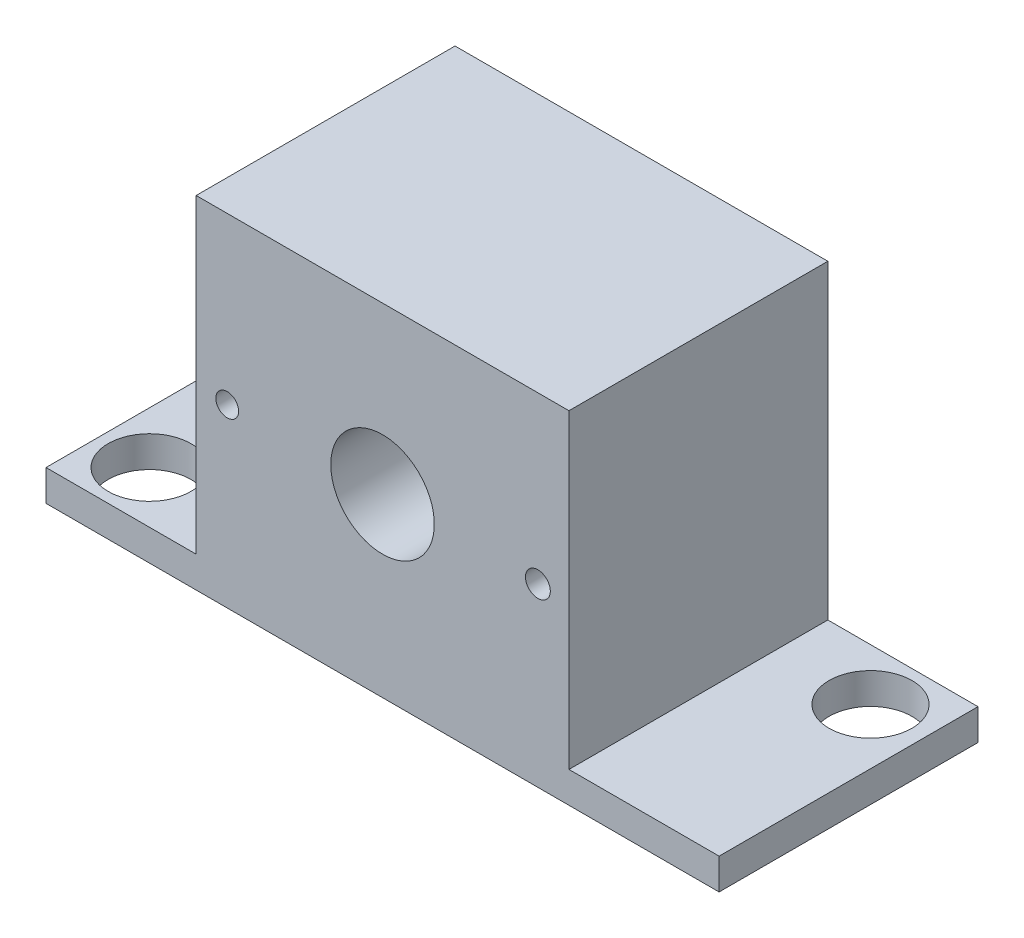
ISO-10303-21;
HEADER;
FILE_DESCRIPTION(('STEP AP214'),'2;1');
FILE_NAME('part.step','',(''),(''),'','','');
FILE_SCHEMA(('AUTOMOTIVE_DESIGN { 1 0 10303 214 1 1 1 1 }'));
ENDSEC;
DATA;
#1=APPLICATION_CONTEXT('core data for automotive mechanical design processes');
#2=APPLICATION_PROTOCOL_DEFINITION('international standard','automotive_design',2000,#1);
#3=PRODUCT_CONTEXT('',#1,'mechanical');
#4=PRODUCT('Part','Part','',(#3));
#5=PRODUCT_RELATED_PRODUCT_CATEGORY('part','',(#4));
#6=PRODUCT_DEFINITION_FORMATION('','',#4);
#7=PRODUCT_DEFINITION_CONTEXT('part definition',#1,'design');
#8=PRODUCT_DEFINITION('design','',#6,#7);
#9=PRODUCT_DEFINITION_SHAPE('','',#8);
#10=(LENGTH_UNIT() NAMED_UNIT(*) SI_UNIT(.MILLI.,.METRE.));
#11=(NAMED_UNIT(*) PLANE_ANGLE_UNIT() SI_UNIT($,.RADIAN.));
#12=(NAMED_UNIT(*) SI_UNIT($,.STERADIAN.) SOLID_ANGLE_UNIT());
#13=UNCERTAINTY_MEASURE_WITH_UNIT(LENGTH_MEASURE(1.E-05),#10,'distance_accuracy_value','');
#14=(GEOMETRIC_REPRESENTATION_CONTEXT(3) GLOBAL_UNCERTAINTY_ASSIGNED_CONTEXT((#13)) GLOBAL_UNIT_ASSIGNED_CONTEXT((#10,
#11,#12)) REPRESENTATION_CONTEXT('',''));
#15=CARTESIAN_POINT('',(0.,0.,0.));
#16=DIRECTION('',(0.,0.,1.));
#17=DIRECTION('',(1.,0.,0.));
#18=AXIS2_PLACEMENT_3D('',#15,#16,#17);
#19=CARTESIAN_POINT('',(-32.5,3.,-12.5));
#20=DIRECTION('',(0.,0.,1.));
#21=DIRECTION('',(1.,0.,0.));
#22=AXIS2_PLACEMENT_3D('',#19,#20,#21);
#23=PLANE('',#22);
#24=CARTESIAN_POINT('',(-15.,17.,-12.5));
#25=DIRECTION('',(0.,0.,-1.));
#26=DIRECTION('',(-1.,0.,0.));
#27=AXIS2_PLACEMENT_3D('',#24,#25,#26);
#28=CIRCLE('',#27,1.09999999999999);
#29=CARTESIAN_POINT('',(-16.1,17.,-12.5));
#30=VERTEX_POINT('',#29);
#31=EDGE_CURVE('E209',#30,#30,#28,.T.);
#32=ORIENTED_EDGE('',*,*,#31,.F.);
#33=EDGE_LOOP('',(#32));
#34=FACE_BOUND('',#33,.T.);
#35=CARTESIAN_POINT('',(15.,17.,-12.5));
#36=DIRECTION('',(0.,0.,-1.));
#37=DIRECTION('',(-1.,0.,0.));
#38=AXIS2_PLACEMENT_3D('',#35,#36,#37);
#39=CIRCLE('',#38,1.2);
#40=CARTESIAN_POINT('',(13.8,17.,-12.5));
#41=VERTEX_POINT('',#40);
#42=EDGE_CURVE('E198',#41,#41,#39,.T.);
#43=ORIENTED_EDGE('',*,*,#42,.F.);
#44=EDGE_LOOP('',(#43));
#45=FACE_BOUND('',#44,.T.);
#46=DIRECTION('',(-1.,0.,0.));
#47=VECTOR('',#46,1.);
#48=CARTESIAN_POINT('',(-32.5,0.,-12.5));
#49=LINE('',#48,#47);
#50=CARTESIAN_POINT('',(32.5,0.,-12.5));
#51=VERTEX_POINT('',#50);
#52=CARTESIAN_POINT('',(-32.5,0.,-12.5));
#53=VERTEX_POINT('',#52);
#54=EDGE_CURVE('E457',#51,#53,#49,.T.);
#55=ORIENTED_EDGE('',*,*,#54,.T.);
#56=DIRECTION('',(0.,-1.,0.));
#57=VECTOR('',#56,1.);
#58=CARTESIAN_POINT('',(-32.5,3.,-12.5));
#59=LINE('',#58,#57);
#60=CARTESIAN_POINT('',(-32.5,3.,-12.5));
#61=VERTEX_POINT('',#60);
#62=EDGE_CURVE('E43',#61,#53,#59,.T.);
#63=ORIENTED_EDGE('',*,*,#62,.F.);
#64=DIRECTION('',(-1.,0.,0.));
#65=VECTOR('',#64,1.);
#66=CARTESIAN_POINT('',(-32.5,3.,-12.5));
#67=LINE('',#66,#65);
#68=CARTESIAN_POINT('',(-18.,3.,-12.5));
#69=VERTEX_POINT('',#68);
#70=EDGE_CURVE('E476',#69,#61,#67,.T.);
#71=ORIENTED_EDGE('',*,*,#70,.F.);
#72=DIRECTION('',(0.,1.,0.));
#73=VECTOR('',#72,1.);
#74=CARTESIAN_POINT('',(-18.,33.,-12.5));
#75=LINE('',#74,#73);
#76=CARTESIAN_POINT('',(-18.,33.,-12.5));
#77=VERTEX_POINT('',#76);
#78=EDGE_CURVE('E170',#69,#77,#75,.T.);
#79=ORIENTED_EDGE('',*,*,#78,.T.);
#80=DIRECTION('',(1.,0.,0.));
#81=VECTOR('',#80,1.);
#82=CARTESIAN_POINT('',(18.,33.,-12.5));
#83=LINE('',#82,#81);
#84=CARTESIAN_POINT('',(18.,33.,-12.5));
#85=VERTEX_POINT('',#84);
#86=EDGE_CURVE('E174',#77,#85,#83,.T.);
#87=ORIENTED_EDGE('',*,*,#86,.T.);
#88=DIRECTION('',(0.,-1.,0.));
#89=VECTOR('',#88,1.);
#90=CARTESIAN_POINT('',(18.,33.,-12.5));
#91=LINE('',#90,#89);
#92=CARTESIAN_POINT('',(18.,3.,-12.5));
#93=VERTEX_POINT('',#92);
#94=EDGE_CURVE('E182',#85,#93,#91,.T.);
#95=ORIENTED_EDGE('',*,*,#94,.T.);
#96=CARTESIAN_POINT('',(32.5,3.,-12.5));
#97=VERTEX_POINT('',#96);
#98=EDGE_CURVE('E472',#97,#93,#67,.T.);
#99=ORIENTED_EDGE('',*,*,#98,.F.);
#100=DIRECTION('',(0.,-1.,0.));
#101=VECTOR('',#100,1.);
#102=CARTESIAN_POINT('',(32.5,3.,-12.5));
#103=LINE('',#102,#101);
#104=EDGE_CURVE('E11',#97,#51,#103,.T.);
#105=ORIENTED_EDGE('',*,*,#104,.T.);
#106=EDGE_LOOP('',(#55,#63,#71,#79,#87,#95,#99,#105));
#107=FACE_BOUND('',#106,.T.);
#108=DIRECTION('',(-1.,0.,0.));
#109=VECTOR('',#108,1.);
#110=CARTESIAN_POINT('',(15.,30.,-12.5));
#111=LINE('',#110,#109);
#112=CARTESIAN_POINT('',(15.,30.,-12.5));
#113=VERTEX_POINT('',#112);
#114=CARTESIAN_POINT('',(-15.,30.,-12.5));
#115=VERTEX_POINT('',#114);
#116=EDGE_CURVE('E51',#113,#115,#111,.T.);
#117=ORIENTED_EDGE('',*,*,#116,.T.);
#118=DIRECTION('',(0.,-1.,0.));
#119=VECTOR('',#118,1.);
#120=CARTESIAN_POINT('',(-15.,30.,-12.5));
#121=LINE('',#120,#119);
#122=CARTESIAN_POINT('',(-15.,19.5,-12.5));
#123=VERTEX_POINT('',#122);
#124=EDGE_CURVE('E169',#115,#123,#121,.T.);
#125=ORIENTED_EDGE('',*,*,#124,.T.);
#126=CARTESIAN_POINT('',(-15.,17.,-12.5));
#127=DIRECTION('',(0.,0.,-1.));
#128=DIRECTION('',(-1.,0.,0.));
#129=AXIS2_PLACEMENT_3D('',#126,#127,#128);
#130=CIRCLE('',#129,2.5);
#131=CARTESIAN_POINT('',(-15.,14.5,-12.5));
#132=VERTEX_POINT('',#131);
#133=EDGE_CURVE('E229',#123,#132,#130,.T.);
#134=ORIENTED_EDGE('',*,*,#133,.T.);
#135=DIRECTION('',(0.,-1.,0.));
#136=VECTOR('',#135,1.);
#137=CARTESIAN_POINT('',(-15.,14.5,-12.5));
#138=LINE('',#137,#136);
#139=CARTESIAN_POINT('',(-15.,4.,-12.5));
#140=VERTEX_POINT('',#139);
#141=EDGE_CURVE('E232',#132,#140,#138,.T.);
#142=ORIENTED_EDGE('',*,*,#141,.T.);
#143=DIRECTION('',(-1.,0.,0.));
#144=VECTOR('',#143,1.);
#145=CARTESIAN_POINT('',(15.,4.,-12.5));
#146=LINE('',#145,#144);
#147=CARTESIAN_POINT('',(15.,4.,-12.5));
#148=VERTEX_POINT('',#147);
#149=EDGE_CURVE('E235',#148,#140,#146,.T.);
#150=ORIENTED_EDGE('',*,*,#149,.F.);
#151=DIRECTION('',(0.,-1.,0.));
#152=VECTOR('',#151,1.);
#153=CARTESIAN_POINT('',(15.,14.5,-12.5));
#154=LINE('',#153,#152);
#155=CARTESIAN_POINT('',(15.,14.5,-12.5));
#156=VERTEX_POINT('',#155);
#157=EDGE_CURVE('E238',#156,#148,#154,.T.);
#158=ORIENTED_EDGE('',*,*,#157,.F.);
#159=CARTESIAN_POINT('',(15.,17.,-12.5));
#160=DIRECTION('',(0.,0.,-1.));
#161=DIRECTION('',(-1.,0.,0.));
#162=AXIS2_PLACEMENT_3D('',#159,#160,#161);
#163=CIRCLE('',#162,2.5);
#164=CARTESIAN_POINT('',(15.,19.5,-12.5));
#165=VERTEX_POINT('',#164);
#166=EDGE_CURVE('E241',#156,#165,#163,.T.);
#167=ORIENTED_EDGE('',*,*,#166,.T.);
#168=DIRECTION('',(0.,-1.,0.));
#169=VECTOR('',#168,1.);
#170=CARTESIAN_POINT('',(15.,30.,-12.5));
#171=LINE('',#170,#169);
#172=EDGE_CURVE('E165',#113,#165,#171,.T.);
#173=ORIENTED_EDGE('',*,*,#172,.F.);
#174=EDGE_LOOP('',(#117,#125,#134,#142,#150,#158,#167,#173));
#175=FACE_BOUND('',#174,.T.);
#176=ADVANCED_FACE('F34',(#34,#45,#107,#175),#23,.F.);
#177=CARTESIAN_POINT('',(0.,3.,0.));
#178=DIRECTION('',(0.,1.,0.));
#179=DIRECTION('',(0.,0.,1.));
#180=AXIS2_PLACEMENT_3D('',#177,#178,#179);
#181=PLANE('',#180);
#182=CARTESIAN_POINT('',(-27.5,3.,7.5));
#183=DIRECTION('',(0.,1.,0.));
#184=DIRECTION('',(0.,0.,1.));
#185=AXIS2_PLACEMENT_3D('',#182,#183,#184);
#186=CIRCLE('',#185,4.);
#187=CARTESIAN_POINT('',(-27.5,3.,11.5));
#188=VERTEX_POINT('',#187);
#189=EDGE_CURVE('E458',#188,#188,#186,.T.);
#190=ORIENTED_EDGE('',*,*,#189,.F.);
#191=EDGE_LOOP('',(#190));
#192=FACE_BOUND('',#191,.T.);
#193=DIRECTION('',(1.,0.,0.));
#194=VECTOR('',#193,1.);
#195=CARTESIAN_POINT('',(-32.5,3.,12.5));
#196=LINE('',#195,#194);
#197=CARTESIAN_POINT('',(-32.5,3.,12.5));
#198=VERTEX_POINT('',#197);
#199=CARTESIAN_POINT('',(-18.,3.,12.5));
#200=VERTEX_POINT('',#199);
#201=EDGE_CURVE('E454',#198,#200,#196,.T.);
#202=ORIENTED_EDGE('',*,*,#201,.T.);
#203=DIRECTION('',(0.,0.,-1.));
#204=VECTOR('',#203,1.);
#205=CARTESIAN_POINT('',(-18.,3.,59.3614980554399));
#206=LINE('',#205,#204);
#207=EDGE_CURVE('E188',#200,#69,#206,.T.);
#208=ORIENTED_EDGE('',*,*,#207,.T.);
#209=ORIENTED_EDGE('',*,*,#70,.T.);
#210=DIRECTION('',(0.,0.,1.));
#211=VECTOR('',#210,1.);
#212=CARTESIAN_POINT('',(-32.5,3.,-12.5));
#213=LINE('',#212,#211);
#214=EDGE_CURVE('E475',#61,#198,#213,.T.);
#215=ORIENTED_EDGE('',*,*,#214,.T.);
#216=EDGE_LOOP('',(#202,#208,#209,#215));
#217=FACE_BOUND('',#216,.T.);
#218=ADVANCED_FACE('F288',(#192,#217),#181,.T.);
#219=DIRECTION('',(0.,0.,-1.));
#220=VECTOR('',#219,1.);
#221=CARTESIAN_POINT('',(18.,3.,59.3614980554399));
#222=LINE('',#221,#220);
#223=CARTESIAN_POINT('',(18.,3.,12.5));
#224=VERTEX_POINT('',#223);
#225=EDGE_CURVE('E59',#224,#93,#222,.T.);
#226=ORIENTED_EDGE('',*,*,#225,.F.);
#227=CARTESIAN_POINT('',(32.5,3.,12.5));
#228=VERTEX_POINT('',#227);
#229=EDGE_CURVE('E482',#224,#228,#196,.T.);
#230=ORIENTED_EDGE('',*,*,#229,.T.);
#231=DIRECTION('',(0.,0.,-1.));
#232=VECTOR('',#231,1.);
#233=CARTESIAN_POINT('',(32.5,3.,-12.5));
#234=LINE('',#233,#232);
#235=EDGE_CURVE('E446',#228,#97,#234,.T.);
#236=ORIENTED_EDGE('',*,*,#235,.T.);
#237=ORIENTED_EDGE('',*,*,#98,.T.);
#238=EDGE_LOOP('',(#226,#230,#236,#237));
#239=FACE_BOUND('',#238,.T.);
#240=CARTESIAN_POINT('',(27.11974152264,3.,-7.5));
#241=DIRECTION('',(0.,1.,0.));
#242=DIRECTION('',(0.,0.,1.));
#243=AXIS2_PLACEMENT_3D('',#240,#241,#242);
#244=CIRCLE('',#243,4.00000000000001);
#245=CARTESIAN_POINT('',(27.11974152264,3.,-3.49999999999999));
#246=VERTEX_POINT('',#245);
#247=EDGE_CURVE('E505',#246,#246,#244,.T.);
#248=ORIENTED_EDGE('',*,*,#247,.F.);
#249=EDGE_LOOP('',(#248));
#250=FACE_BOUND('',#249,.T.);
#251=ADVANCED_FACE('F293',(#239,#250),#181,.T.);
#252=CARTESIAN_POINT('',(0.,0.,0.));
#253=DIRECTION('',(0.,1.,0.));
#254=DIRECTION('',(0.,0.,1.));
#255=AXIS2_PLACEMENT_3D('',#252,#253,#254);
#256=PLANE('',#255);
#257=DIRECTION('',(0.,0.,-1.));
#258=VECTOR('',#257,1.);
#259=CARTESIAN_POINT('',(32.5,0.,-12.5));
#260=LINE('',#259,#258);
#261=CARTESIAN_POINT('',(32.5,0.,12.5));
#262=VERTEX_POINT('',#261);
#263=EDGE_CURVE('E452',#262,#51,#260,.T.);
#264=ORIENTED_EDGE('',*,*,#263,.F.);
#265=DIRECTION('',(1.,0.,0.));
#266=VECTOR('',#265,1.);
#267=CARTESIAN_POINT('',(-32.5,0.,12.5));
#268=LINE('',#267,#266);
#269=CARTESIAN_POINT('',(-32.5,0.,12.5));
#270=VERTEX_POINT('',#269);
#271=EDGE_CURVE('E437',#270,#262,#268,.T.);
#272=ORIENTED_EDGE('',*,*,#271,.F.);
#273=DIRECTION('',(0.,0.,1.));
#274=VECTOR('',#273,1.);
#275=CARTESIAN_POINT('',(-32.5,0.,-12.5));
#276=LINE('',#275,#274);
#277=EDGE_CURVE('E447',#53,#270,#276,.T.);
#278=ORIENTED_EDGE('',*,*,#277,.F.);
#279=ORIENTED_EDGE('',*,*,#54,.F.);
#280=EDGE_LOOP('',(#264,#272,#278,#279));
#281=FACE_BOUND('',#280,.T.);
#282=CARTESIAN_POINT('',(-27.5,0.,7.5));
#283=DIRECTION('',(0.,1.,0.));
#284=DIRECTION('',(0.,0.,1.));
#285=AXIS2_PLACEMENT_3D('',#282,#283,#284);
#286=CIRCLE('',#285,4.);
#287=CARTESIAN_POINT('',(-27.5,0.,11.5));
#288=VERTEX_POINT('',#287);
#289=EDGE_CURVE('E462',#288,#288,#286,.T.);
#290=ORIENTED_EDGE('',*,*,#289,.T.);
#291=EDGE_LOOP('',(#290));
#292=FACE_BOUND('',#291,.T.);
#293=CARTESIAN_POINT('',(27.11974152264,0.,-7.5));
#294=DIRECTION('',(0.,1.,0.));
#295=DIRECTION('',(0.,0.,1.));
#296=AXIS2_PLACEMENT_3D('',#293,#294,#295);
#297=CIRCLE('',#296,4.00000000000001);
#298=CARTESIAN_POINT('',(27.11974152264,0.,-3.49999999999999));
#299=VERTEX_POINT('',#298);
#300=EDGE_CURVE('E501',#299,#299,#297,.T.);
#301=ORIENTED_EDGE('',*,*,#300,.T.);
#302=EDGE_LOOP('',(#301));
#303=FACE_BOUND('',#302,.T.);
#304=ADVANCED_FACE('F308',(#281,#292,#303),#256,.F.);
#305=CARTESIAN_POINT('',(32.5,3.,-12.5));
#306=DIRECTION('',(-1.,0.,0.));
#307=DIRECTION('',(0.,0.,1.));
#308=AXIS2_PLACEMENT_3D('',#305,#306,#307);
#309=PLANE('',#308);
#310=ORIENTED_EDGE('',*,*,#263,.T.);
#311=ORIENTED_EDGE('',*,*,#104,.F.);
#312=ORIENTED_EDGE('',*,*,#235,.F.);
#313=DIRECTION('',(0.,-1.,0.));
#314=VECTOR('',#313,1.);
#315=CARTESIAN_POINT('',(32.5,3.,12.5));
#316=LINE('',#315,#314);
#317=EDGE_CURVE('E439',#228,#262,#316,.T.);
#318=ORIENTED_EDGE('',*,*,#317,.T.);
#319=EDGE_LOOP('',(#310,#311,#312,#318));
#320=FACE_BOUND('',#319,.T.);
#321=ADVANCED_FACE('F36',(#320),#309,.F.);
#322=CARTESIAN_POINT('',(-32.5,3.,-12.5));
#323=DIRECTION('',(1.,0.,0.));
#324=DIRECTION('',(0.,0.,-1.));
#325=AXIS2_PLACEMENT_3D('',#322,#323,#324);
#326=PLANE('',#325);
#327=ORIENTED_EDGE('',*,*,#277,.T.);
#328=DIRECTION('',(0.,-1.,0.));
#329=VECTOR('',#328,1.);
#330=CARTESIAN_POINT('',(-32.5,3.,12.5));
#331=LINE('',#330,#329);
#332=EDGE_CURVE('E443',#198,#270,#331,.T.);
#333=ORIENTED_EDGE('',*,*,#332,.F.);
#334=ORIENTED_EDGE('',*,*,#214,.F.);
#335=ORIENTED_EDGE('',*,*,#62,.T.);
#336=EDGE_LOOP('',(#327,#333,#334,#335));
#337=FACE_BOUND('',#336,.T.);
#338=ADVANCED_FACE('F299',(#337),#326,.F.);
#339=CARTESIAN_POINT('',(-32.5,3.,12.5));
#340=DIRECTION('',(0.,0.,-1.));
#341=DIRECTION('',(-1.,0.,0.));
#342=AXIS2_PLACEMENT_3D('',#339,#340,#341);
#343=PLANE('',#342);
#344=CARTESIAN_POINT('',(-15.,17.,12.5));
#345=DIRECTION('',(0.,0.,-1.));
#346=DIRECTION('',(-1.,0.,0.));
#347=AXIS2_PLACEMENT_3D('',#344,#345,#346);
#348=CIRCLE('',#347,1.09999999999999);
#349=CARTESIAN_POINT('',(-16.1,17.,12.5));
#350=VERTEX_POINT('',#349);
#351=EDGE_CURVE('E38',#350,#350,#348,.T.);
#352=ORIENTED_EDGE('',*,*,#351,.T.);
#353=EDGE_LOOP('',(#352));
#354=FACE_BOUND('',#353,.T.);
#355=CARTESIAN_POINT('',(15.,17.,12.5));
#356=DIRECTION('',(0.,0.,-1.));
#357=DIRECTION('',(-1.,0.,0.));
#358=AXIS2_PLACEMENT_3D('',#355,#356,#357);
#359=CIRCLE('',#358,1.2);
#360=CARTESIAN_POINT('',(13.8,17.,12.5));
#361=VERTEX_POINT('',#360);
#362=EDGE_CURVE('E195',#361,#361,#359,.T.);
#363=ORIENTED_EDGE('',*,*,#362,.T.);
#364=EDGE_LOOP('',(#363));
#365=FACE_BOUND('',#364,.T.);
#366=CARTESIAN_POINT('',(0.,17.,12.5));
#367=DIRECTION('',(0.,0.,-1.));
#368=DIRECTION('',(-1.,0.,0.));
#369=AXIS2_PLACEMENT_3D('',#366,#367,#368);
#370=CIRCLE('',#369,5.);
#371=CARTESIAN_POINT('',(-5.,17.,12.5));
#372=VERTEX_POINT('',#371);
#373=EDGE_CURVE('E202',#372,#372,#370,.T.);
#374=ORIENTED_EDGE('',*,*,#373,.T.);
#375=EDGE_LOOP('',(#374));
#376=FACE_BOUND('',#375,.T.);
#377=ORIENTED_EDGE('',*,*,#271,.T.);
#378=ORIENTED_EDGE('',*,*,#317,.F.);
#379=ORIENTED_EDGE('',*,*,#229,.F.);
#380=DIRECTION('',(0.,1.,0.));
#381=VECTOR('',#380,1.);
#382=CARTESIAN_POINT('',(18.,33.,12.5));
#383=LINE('',#382,#381);
#384=CARTESIAN_POINT('',(18.,33.,12.5));
#385=VERTEX_POINT('',#384);
#386=EDGE_CURVE('E190',#224,#385,#383,.T.);
#387=ORIENTED_EDGE('',*,*,#386,.T.);
#388=DIRECTION('',(-1.,0.,0.));
#389=VECTOR('',#388,1.);
#390=CARTESIAN_POINT('',(18.,33.,12.5));
#391=LINE('',#390,#389);
#392=CARTESIAN_POINT('',(-18.,33.,12.5));
#393=VERTEX_POINT('',#392);
#394=EDGE_CURVE('E498',#385,#393,#391,.T.);
#395=ORIENTED_EDGE('',*,*,#394,.T.);
#396=DIRECTION('',(0.,-1.,0.));
#397=VECTOR('',#396,1.);
#398=CARTESIAN_POINT('',(-18.,33.,12.5));
#399=LINE('',#398,#397);
#400=EDGE_CURVE('E495',#393,#200,#399,.T.);
#401=ORIENTED_EDGE('',*,*,#400,.T.);
#402=ORIENTED_EDGE('',*,*,#201,.F.);
#403=ORIENTED_EDGE('',*,*,#332,.T.);
#404=EDGE_LOOP('',(#377,#378,#379,#387,#395,#401,#402,#403));
#405=FACE_BOUND('',#404,.T.);
#406=ADVANCED_FACE('F302',(#354,#365,#376,#405),#343,.F.);
#407=CARTESIAN_POINT('',(-27.5,3.,7.5));
#408=DIRECTION('',(0.,-1.,0.));
#409=DIRECTION('',(0.,0.,-1.));
#410=AXIS2_PLACEMENT_3D('',#407,#408,#409);
#411=CYLINDRICAL_SURFACE('',#410,4.);
#412=ORIENTED_EDGE('',*,*,#189,.T.);
#413=EDGE_LOOP('',(#412));
#414=FACE_BOUND('',#413,.T.);
#415=ORIENTED_EDGE('',*,*,#289,.F.);
#416=EDGE_LOOP('',(#415));
#417=FACE_BOUND('',#416,.T.);
#418=ADVANCED_FACE('F306',(#414,#417),#411,.F.);
#419=CARTESIAN_POINT('',(27.11974152264,3.,-7.5));
#420=DIRECTION('',(0.,-1.,0.));
#421=DIRECTION('',(0.,0.,-1.));
#422=AXIS2_PLACEMENT_3D('',#419,#420,#421);
#423=CYLINDRICAL_SURFACE('',#422,4.00000000000001);
#424=ORIENTED_EDGE('',*,*,#247,.T.);
#425=EDGE_LOOP('',(#424));
#426=FACE_BOUND('',#425,.T.);
#427=ORIENTED_EDGE('',*,*,#300,.F.);
#428=EDGE_LOOP('',(#427));
#429=FACE_BOUND('',#428,.T.);
#430=ADVANCED_FACE('F315',(#426,#429),#423,.F.);
#431=CARTESIAN_POINT('',(-18.,33.,59.3614980554399));
#432=DIRECTION('',(-1.,0.,0.));
#433=DIRECTION('',(0.,-1.,0.));
#434=AXIS2_PLACEMENT_3D('',#431,#432,#433);
#435=PLANE('',#434);
#436=ORIENTED_EDGE('',*,*,#400,.F.);
#437=DIRECTION('',(0.,0.,-1.));
#438=VECTOR('',#437,1.);
#439=CARTESIAN_POINT('',(-18.,33.,59.3614980554399));
#440=LINE('',#439,#438);
#441=EDGE_CURVE('E491',#393,#77,#440,.T.);
#442=ORIENTED_EDGE('',*,*,#441,.T.);
#443=ORIENTED_EDGE('',*,*,#78,.F.);
#444=ORIENTED_EDGE('',*,*,#207,.F.);
#445=EDGE_LOOP('',(#436,#442,#443,#444));
#446=FACE_BOUND('',#445,.T.);
#447=ADVANCED_FACE('F319',(#446),#435,.T.);
#448=CARTESIAN_POINT('',(18.,33.,59.3614980554399));
#449=DIRECTION('',(1.,0.,0.));
#450=DIRECTION('',(0.,1.,0.));
#451=AXIS2_PLACEMENT_3D('',#448,#449,#450);
#452=PLANE('',#451);
#453=ORIENTED_EDGE('',*,*,#386,.F.);
#454=ORIENTED_EDGE('',*,*,#225,.T.);
#455=ORIENTED_EDGE('',*,*,#94,.F.);
#456=DIRECTION('',(0.,0.,-1.));
#457=VECTOR('',#456,1.);
#458=CARTESIAN_POINT('',(18.,33.,59.3614980554399));
#459=LINE('',#458,#457);
#460=EDGE_CURVE('E488',#385,#85,#459,.T.);
#461=ORIENTED_EDGE('',*,*,#460,.F.);
#462=EDGE_LOOP('',(#453,#454,#455,#461));
#463=FACE_BOUND('',#462,.T.);
#464=ADVANCED_FACE('F323',(#463),#452,.T.);
#465=CARTESIAN_POINT('',(18.,33.,59.3614980554399));
#466=DIRECTION('',(0.,1.,0.));
#467=DIRECTION('',(0.,0.,1.));
#468=AXIS2_PLACEMENT_3D('',#465,#466,#467);
#469=PLANE('',#468);
#470=ORIENTED_EDGE('',*,*,#394,.F.);
#471=ORIENTED_EDGE('',*,*,#460,.T.);
#472=ORIENTED_EDGE('',*,*,#86,.F.);
#473=ORIENTED_EDGE('',*,*,#441,.F.);
#474=EDGE_LOOP('',(#470,#471,#472,#473));
#475=FACE_BOUND('',#474,.T.);
#476=ADVANCED_FACE('F325',(#475),#469,.T.);
#477=CARTESIAN_POINT('',(15.,30.,-7.5));
#478=DIRECTION('',(0.,-1.,0.));
#479=DIRECTION('',(0.,0.,-1.));
#480=AXIS2_PLACEMENT_3D('',#477,#478,#479);
#481=PLANE('',#480);
#482=ORIENTED_EDGE('',*,*,#116,.F.);
#483=DIRECTION('',(0.,0.,-1.));
#484=VECTOR('',#483,1.);
#485=CARTESIAN_POINT('',(15.,30.,-7.5));
#486=LINE('',#485,#484);
#487=CARTESIAN_POINT('',(15.,30.,-7.5));
#488=VERTEX_POINT('',#487);
#489=EDGE_CURVE('E164',#488,#113,#486,.T.);
#490=ORIENTED_EDGE('',*,*,#489,.F.);
#491=DIRECTION('',(-1.,0.,0.));
#492=VECTOR('',#491,1.);
#493=CARTESIAN_POINT('',(15.,30.,-7.5));
#494=LINE('',#493,#492);
#495=CARTESIAN_POINT('',(-15.,30.,-7.5));
#496=VERTEX_POINT('',#495);
#497=EDGE_CURVE('E154',#488,#496,#494,.T.);
#498=ORIENTED_EDGE('',*,*,#497,.T.);
#499=DIRECTION('',(0.,0.,-1.));
#500=VECTOR('',#499,1.);
#501=CARTESIAN_POINT('',(-15.,30.,-7.5));
#502=LINE('',#501,#500);
#503=EDGE_CURVE('E163',#496,#115,#502,.T.);
#504=ORIENTED_EDGE('',*,*,#503,.T.);
#505=EDGE_LOOP('',(#482,#490,#498,#504));
#506=FACE_BOUND('',#505,.T.);
#507=ADVANCED_FACE('F162',(#506),#481,.T.);
#508=CARTESIAN_POINT('',(-15.,30.,-7.5));
#509=DIRECTION('',(1.,0.,0.));
#510=DIRECTION('',(0.,1.,0.));
#511=AXIS2_PLACEMENT_3D('',#508,#509,#510);
#512=PLANE('',#511);
#513=ORIENTED_EDGE('',*,*,#124,.F.);
#514=ORIENTED_EDGE('',*,*,#503,.F.);
#515=DIRECTION('',(0.,-1.,0.));
#516=VECTOR('',#515,1.);
#517=CARTESIAN_POINT('',(-15.,30.,-7.5));
#518=LINE('',#517,#516);
#519=CARTESIAN_POINT('',(-15.,19.5,-7.5));
#520=VERTEX_POINT('',#519);
#521=EDGE_CURVE('E150',#496,#520,#518,.T.);
#522=ORIENTED_EDGE('',*,*,#521,.T.);
#523=DIRECTION('',(0.,0.,-1.));
#524=VECTOR('',#523,1.);
#525=CARTESIAN_POINT('',(-15.,19.5,-7.5));
#526=LINE('',#525,#524);
#527=EDGE_CURVE('E171',#520,#123,#526,.T.);
#528=ORIENTED_EDGE('',*,*,#527,.T.);
#529=EDGE_LOOP('',(#513,#514,#522,#528));
#530=FACE_BOUND('',#529,.T.);
#531=ADVANCED_FACE('F167',(#530),#512,.T.);
#532=CARTESIAN_POINT('',(-15.,17.,-7.5));
#533=DIRECTION('',(0.,0.,-1.));
#534=DIRECTION('',(-1.,0.,0.));
#535=AXIS2_PLACEMENT_3D('',#532,#533,#534);
#536=CYLINDRICAL_SURFACE('',#535,2.5);
#537=ORIENTED_EDGE('',*,*,#133,.F.);
#538=ORIENTED_EDGE('',*,*,#527,.F.);
#539=CARTESIAN_POINT('',(-15.,17.,-7.5));
#540=DIRECTION('',(0.,0.,-1.));
#541=DIRECTION('',(-1.,0.,0.));
#542=AXIS2_PLACEMENT_3D('',#539,#540,#541);
#543=CIRCLE('',#542,2.5);
#544=CARTESIAN_POINT('',(-15.,14.5,-7.5));
#545=VERTEX_POINT('',#544);
#546=EDGE_CURVE('E157',#520,#545,#543,.T.);
#547=ORIENTED_EDGE('',*,*,#546,.T.);
#548=DIRECTION('',(0.,0.,-1.));
#549=VECTOR('',#548,1.);
#550=CARTESIAN_POINT('',(-15.,14.5,-7.5));
#551=LINE('',#550,#549);
#552=EDGE_CURVE('E176',#545,#132,#551,.T.);
#553=ORIENTED_EDGE('',*,*,#552,.T.);
#554=EDGE_LOOP('',(#537,#538,#547,#553));
#555=FACE_BOUND('',#554,.T.);
#556=ADVANCED_FACE('F258',(#555),#536,.T.);
#557=CARTESIAN_POINT('',(-15.,14.5,-7.5));
#558=DIRECTION('',(1.,0.,0.));
#559=DIRECTION('',(0.,0.,-1.));
#560=AXIS2_PLACEMENT_3D('',#557,#558,#559);
#561=PLANE('',#560);
#562=ORIENTED_EDGE('',*,*,#141,.F.);
#563=ORIENTED_EDGE('',*,*,#552,.F.);
#564=DIRECTION('',(0.,-1.,0.));
#565=VECTOR('',#564,1.);
#566=CARTESIAN_POINT('',(-15.,14.5,-7.5));
#567=LINE('',#566,#565);
#568=CARTESIAN_POINT('',(-15.,4.,-7.5));
#569=VERTEX_POINT('',#568);
#570=EDGE_CURVE('E215',#545,#569,#567,.T.);
#571=ORIENTED_EDGE('',*,*,#570,.T.);
#572=DIRECTION('',(0.,0.,-1.));
#573=VECTOR('',#572,1.);
#574=CARTESIAN_POINT('',(-15.,4.,-7.5));
#575=LINE('',#574,#573);
#576=EDGE_CURVE('E253',#569,#140,#575,.T.);
#577=ORIENTED_EDGE('',*,*,#576,.T.);
#578=EDGE_LOOP('',(#562,#563,#571,#577));
#579=FACE_BOUND('',#578,.T.);
#580=ADVANCED_FACE('F260',(#579),#561,.T.);
#581=CARTESIAN_POINT('',(15.,4.,-7.5));
#582=DIRECTION('',(0.,-1.,0.));
#583=DIRECTION('',(0.,0.,-1.));
#584=AXIS2_PLACEMENT_3D('',#581,#582,#583);
#585=PLANE('',#584);
#586=ORIENTED_EDGE('',*,*,#149,.T.);
#587=ORIENTED_EDGE('',*,*,#576,.F.);
#588=DIRECTION('',(-1.,0.,0.));
#589=VECTOR('',#588,1.);
#590=CARTESIAN_POINT('',(15.,4.,-7.5));
#591=LINE('',#590,#589);
#592=CARTESIAN_POINT('',(15.,4.,-7.5));
#593=VERTEX_POINT('',#592);
#594=EDGE_CURVE('E217',#593,#569,#591,.T.);
#595=ORIENTED_EDGE('',*,*,#594,.F.);
#596=DIRECTION('',(0.,0.,-1.));
#597=VECTOR('',#596,1.);
#598=CARTESIAN_POINT('',(15.,4.,-7.5));
#599=LINE('',#598,#597);
#600=EDGE_CURVE('E251',#593,#148,#599,.T.);
#601=ORIENTED_EDGE('',*,*,#600,.T.);
#602=EDGE_LOOP('',(#586,#587,#595,#601));
#603=FACE_BOUND('',#602,.T.);
#604=ADVANCED_FACE('F277',(#603),#585,.F.);
#605=CARTESIAN_POINT('',(15.,14.5,-7.5));
#606=DIRECTION('',(1.,0.,0.));
#607=DIRECTION('',(0.,1.,0.));
#608=AXIS2_PLACEMENT_3D('',#605,#606,#607);
#609=PLANE('',#608);
#610=ORIENTED_EDGE('',*,*,#157,.T.);
#611=ORIENTED_EDGE('',*,*,#600,.F.);
#612=DIRECTION('',(0.,-1.,0.));
#613=VECTOR('',#612,1.);
#614=CARTESIAN_POINT('',(15.,14.5,-7.5));
#615=LINE('',#614,#613);
#616=CARTESIAN_POINT('',(15.,14.5,-7.5));
#617=VERTEX_POINT('',#616);
#618=EDGE_CURVE('E220',#617,#593,#615,.T.);
#619=ORIENTED_EDGE('',*,*,#618,.F.);
#620=DIRECTION('',(0.,0.,-1.));
#621=VECTOR('',#620,1.);
#622=CARTESIAN_POINT('',(15.,14.5,-7.5));
#623=LINE('',#622,#621);
#624=EDGE_CURVE('E249',#617,#156,#623,.T.);
#625=ORIENTED_EDGE('',*,*,#624,.T.);
#626=EDGE_LOOP('',(#610,#611,#619,#625));
#627=FACE_BOUND('',#626,.T.);
#628=ADVANCED_FACE('F274',(#627),#609,.F.);
#629=CARTESIAN_POINT('',(15.,17.,-7.5));
#630=DIRECTION('',(0.,0.,-1.));
#631=DIRECTION('',(-1.,0.,0.));
#632=AXIS2_PLACEMENT_3D('',#629,#630,#631);
#633=CYLINDRICAL_SURFACE('',#632,2.5);
#634=ORIENTED_EDGE('',*,*,#166,.F.);
#635=ORIENTED_EDGE('',*,*,#624,.F.);
#636=CARTESIAN_POINT('',(15.,17.,-7.5));
#637=DIRECTION('',(0.,0.,-1.));
#638=DIRECTION('',(-1.,0.,0.));
#639=AXIS2_PLACEMENT_3D('',#636,#637,#638);
#640=CIRCLE('',#639,2.5);
#641=CARTESIAN_POINT('',(15.,19.5,-7.5));
#642=VERTEX_POINT('',#641);
#643=EDGE_CURVE('E223',#617,#642,#640,.T.);
#644=ORIENTED_EDGE('',*,*,#643,.T.);
#645=DIRECTION('',(0.,0.,-1.));
#646=VECTOR('',#645,1.);
#647=CARTESIAN_POINT('',(15.,19.5,-7.5));
#648=LINE('',#647,#646);
#649=EDGE_CURVE('E247',#642,#165,#648,.T.);
#650=ORIENTED_EDGE('',*,*,#649,.T.);
#651=EDGE_LOOP('',(#634,#635,#644,#650));
#652=FACE_BOUND('',#651,.T.);
#653=ADVANCED_FACE('F284',(#652),#633,.T.);
#654=CARTESIAN_POINT('',(15.,30.,-7.5));
#655=DIRECTION('',(1.,0.,0.));
#656=DIRECTION('',(0.,0.,-1.));
#657=AXIS2_PLACEMENT_3D('',#654,#655,#656);
#658=PLANE('',#657);
#659=ORIENTED_EDGE('',*,*,#172,.T.);
#660=ORIENTED_EDGE('',*,*,#649,.F.);
#661=DIRECTION('',(0.,-1.,0.));
#662=VECTOR('',#661,1.);
#663=CARTESIAN_POINT('',(15.,30.,-7.5));
#664=LINE('',#663,#662);
#665=EDGE_CURVE('E225',#488,#642,#664,.T.);
#666=ORIENTED_EDGE('',*,*,#665,.F.);
#667=ORIENTED_EDGE('',*,*,#489,.T.);
#668=EDGE_LOOP('',(#659,#660,#666,#667));
#669=FACE_BOUND('',#668,.T.);
#670=ADVANCED_FACE('F269',(#669),#658,.F.);
#671=CARTESIAN_POINT('',(-15.,17.,-7.5));
#672=DIRECTION('',(0.,0.,-1.));
#673=DIRECTION('',(-1.,0.,0.));
#674=AXIS2_PLACEMENT_3D('',#671,#672,#673);
#675=PLANE('',#674);
#676=CARTESIAN_POINT('',(0.,17.,-7.5));
#677=DIRECTION('',(0.,0.,-1.));
#678=DIRECTION('',(-1.,0.,0.));
#679=AXIS2_PLACEMENT_3D('',#676,#677,#678);
#680=CIRCLE('',#679,5.);
#681=CARTESIAN_POINT('',(-5.,17.,-7.5));
#682=VERTEX_POINT('',#681);
#683=EDGE_CURVE('E197',#682,#682,#680,.T.);
#684=ORIENTED_EDGE('',*,*,#683,.F.);
#685=EDGE_LOOP('',(#684));
#686=FACE_BOUND('',#685,.T.);
#687=ORIENTED_EDGE('',*,*,#497,.F.);
#688=ORIENTED_EDGE('',*,*,#665,.T.);
#689=ORIENTED_EDGE('',*,*,#643,.F.);
#690=ORIENTED_EDGE('',*,*,#618,.T.);
#691=ORIENTED_EDGE('',*,*,#594,.T.);
#692=ORIENTED_EDGE('',*,*,#570,.F.);
#693=ORIENTED_EDGE('',*,*,#546,.F.);
#694=ORIENTED_EDGE('',*,*,#521,.F.);
#695=EDGE_LOOP('',(#687,#688,#689,#690,#691,#692,#693,#694));
#696=FACE_BOUND('',#695,.T.);
#697=ADVANCED_FACE('F152',(#686,#696),#675,.T.);
#698=CARTESIAN_POINT('',(0.,17.,12.50005));
#699=DIRECTION('',(0.,0.,-1.));
#700=DIRECTION('',(-1.,0.,0.));
#701=AXIS2_PLACEMENT_3D('',#698,#699,#700);
#702=CYLINDRICAL_SURFACE('',#701,5.);
#703=ORIENTED_EDGE('',*,*,#683,.T.);
#704=EDGE_LOOP('',(#703));
#705=FACE_BOUND('',#704,.T.);
#706=ORIENTED_EDGE('',*,*,#373,.F.);
#707=EDGE_LOOP('',(#706));
#708=FACE_BOUND('',#707,.T.);
#709=ADVANCED_FACE('F380',(#705,#708),#702,.F.);
#710=CARTESIAN_POINT('',(15.,17.,12.50005));
#711=DIRECTION('',(0.,0.,-1.));
#712=DIRECTION('',(-1.,0.,0.));
#713=AXIS2_PLACEMENT_3D('',#710,#711,#712);
#714=CYLINDRICAL_SURFACE('',#713,1.2);
#715=ORIENTED_EDGE('',*,*,#42,.T.);
#716=EDGE_LOOP('',(#715));
#717=FACE_BOUND('',#716,.T.);
#718=ORIENTED_EDGE('',*,*,#362,.F.);
#719=EDGE_LOOP('',(#718));
#720=FACE_BOUND('',#719,.T.);
#721=ADVANCED_FACE('F389',(#717,#720),#714,.F.);
#722=CARTESIAN_POINT('',(-15.,17.,12.50005));
#723=DIRECTION('',(0.,0.,-1.));
#724=DIRECTION('',(-1.,0.,0.));
#725=AXIS2_PLACEMENT_3D('',#722,#723,#724);
#726=CYLINDRICAL_SURFACE('',#725,1.09999999999999);
#727=ORIENTED_EDGE('',*,*,#31,.T.);
#728=EDGE_LOOP('',(#727));
#729=FACE_BOUND('',#728,.T.);
#730=ORIENTED_EDGE('',*,*,#351,.F.);
#731=EDGE_LOOP('',(#730));
#732=FACE_BOUND('',#731,.T.);
#733=ADVANCED_FACE('F415',(#729,#732),#726,.F.);
#734=CLOSED_SHELL('',(#176,#218,#251,#304,#321,#338,#406,#418,#430,#447,#464,#476,#507,#531,
#556,#580,#604,#628,#653,#670,#697,#709,#721,#733));
#735=MANIFOLD_SOLID_BREP('B2',#734);
#736=ADVANCED_BREP_SHAPE_REPRESENTATION('',(#18,#735),#14);
#737=SHAPE_DEFINITION_REPRESENTATION(#9,#736);
ENDSEC;
END-ISO-10303-21;
